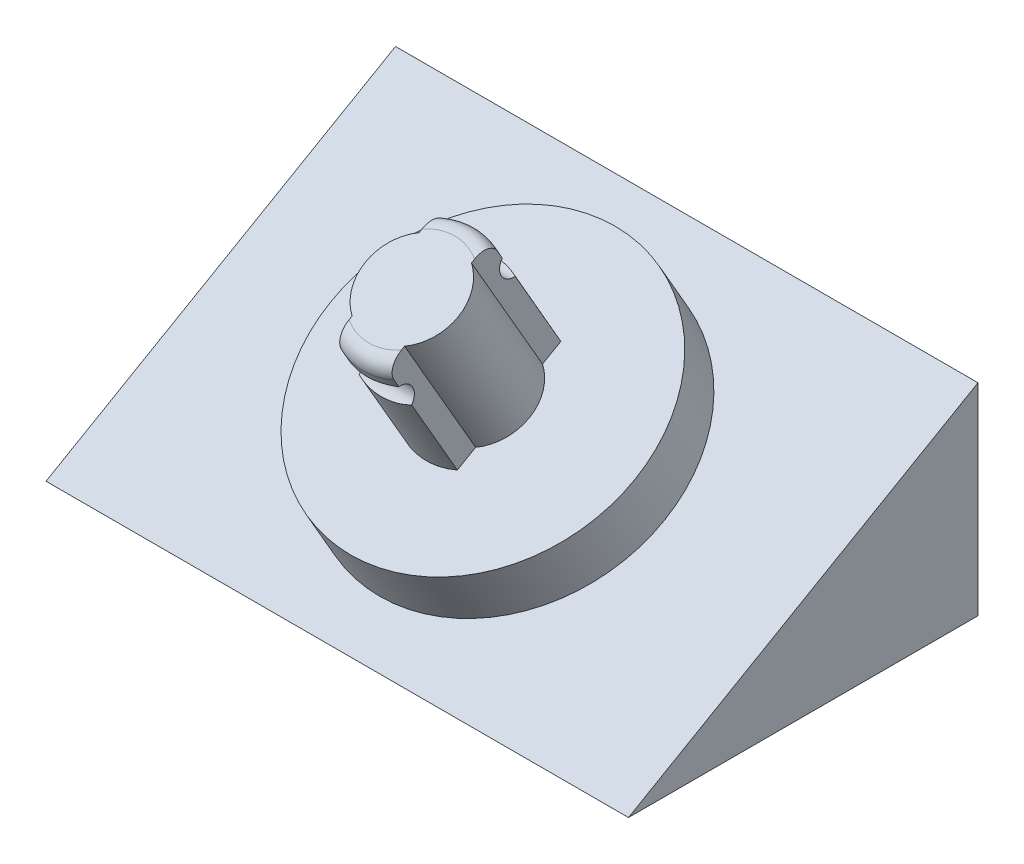
ISO-10303-21;
HEADER;
FILE_DESCRIPTION(('STEP AP214'),'2;1');
FILE_NAME('part.step','',(''),(''),'','','');
FILE_SCHEMA(('AUTOMOTIVE_DESIGN { 1 0 10303 214 1 1 1 1 }'));
ENDSEC;
DATA;
#1=APPLICATION_CONTEXT('core data for automotive mechanical design processes');
#2=APPLICATION_PROTOCOL_DEFINITION('international standard','automotive_design',2000,#1);
#3=PRODUCT_CONTEXT('',#1,'mechanical');
#4=PRODUCT('Part','Part','',(#3));
#5=PRODUCT_RELATED_PRODUCT_CATEGORY('part','',(#4));
#6=PRODUCT_DEFINITION_FORMATION('','',#4);
#7=PRODUCT_DEFINITION_CONTEXT('part definition',#1,'design');
#8=PRODUCT_DEFINITION('design','',#6,#7);
#9=PRODUCT_DEFINITION_SHAPE('','',#8);
#10=(LENGTH_UNIT() NAMED_UNIT(*) SI_UNIT(.MILLI.,.METRE.));
#11=(NAMED_UNIT(*) PLANE_ANGLE_UNIT() SI_UNIT($,.RADIAN.));
#12=(NAMED_UNIT(*) SI_UNIT($,.STERADIAN.) SOLID_ANGLE_UNIT());
#13=UNCERTAINTY_MEASURE_WITH_UNIT(LENGTH_MEASURE(1.E-05),#10,'distance_accuracy_value','');
#14=(GEOMETRIC_REPRESENTATION_CONTEXT(3) GLOBAL_UNCERTAINTY_ASSIGNED_CONTEXT((#13)) GLOBAL_UNIT_ASSIGNED_CONTEXT((#10,
#11,#12)) REPRESENTATION_CONTEXT('',''));
#15=CARTESIAN_POINT('',(0.,0.,0.));
#16=DIRECTION('',(0.,0.,1.));
#17=DIRECTION('',(1.,0.,0.));
#18=AXIS2_PLACEMENT_3D('',#15,#16,#17);
#19=CARTESIAN_POINT('',(0.,14.133534589762,5.15999999999996));
#20=DIRECTION('',(0.,-0.866025403784441,-0.499999999999995));
#21=DIRECTION('',(0.,0.499999999999995,-0.866025403784441));
#22=AXIS2_PLACEMENT_3D('',#19,#20,#21);
#23=CYLINDRICAL_SURFACE('',#22,3.36);
#24=DIRECTION('',(0.,-0.866025403784441,-0.499999999999995));
#25=VECTOR('',#24,1.);
#26=CARTESIAN_POINT('',(1.35,12.5951019458026,7.82464350336022));
#27=LINE('',#26,#25);
#28=CARTESIAN_POINT('',(1.35,11.902281622775,7.42464350336022));
#29=VERTEX_POINT('',#28);
#30=CARTESIAN_POINT('',(1.35,11.474942595738,7.17791920106515));
#31=VERTEX_POINT('',#30);
#32=EDGE_CURVE('E151',#29,#31,#27,.T.);
#33=ORIENTED_EDGE('',*,*,#32,.F.);
#34=CARTESIAN_POINT('',(0.,13.4407142667344,4.75999999999996));
#35=DIRECTION('',(0.,0.866025403784441,0.499999999999995));
#36=DIRECTION('',(0.,-0.499999999999995,0.866025403784441));
#37=AXIS2_PLACEMENT_3D('',#34,#35,#36);
#38=CIRCLE('',#37,3.36);
#39=CARTESIAN_POINT('',(-1.35,11.902281622775,7.42464350336022));
#40=VERTEX_POINT('',#39);
#41=EDGE_CURVE('E44',#29,#40,#38,.F.);
#42=ORIENTED_EDGE('',*,*,#41,.T.);
#43=DIRECTION('',(0.,-0.866025403784441,-0.499999999999995));
#44=VECTOR('',#43,1.);
#45=CARTESIAN_POINT('',(-1.35,12.5951019458026,7.82464350336022));
#46=LINE('',#45,#44);
#47=CARTESIAN_POINT('',(-1.35,11.474942595738,7.17791920106515));
#48=VERTEX_POINT('',#47);
#49=EDGE_CURVE('E170',#40,#48,#46,.T.);
#50=ORIENTED_EDGE('',*,*,#49,.T.);
#51=CARTESIAN_POINT('',(-1.35,11.474942595738,7.17791920106515));
#52=CARTESIAN_POINT('',(-1.31524674092889,11.4730057996449,7.19441032775255));
#53=CARTESIAN_POINT('',(-1.28011415016703,11.4706070055053,7.21001167578529));
#54=CARTESIAN_POINT('',(-1.20921149158938,11.4651583145601,7.23951555228648));
#55=CARTESIAN_POINT('',(-1.17344175679111,11.4621087492431,7.25341894001091));
#56=CARTESIAN_POINT('',(-1.06543820818072,11.4524009484729,7.2926783649312));
#57=CARTESIAN_POINT('',(-0.992380742451243,11.4451744339376,7.31564399241342));
#58=CARTESIAN_POINT('',(-0.844780945021744,11.4308072659534,7.3557892039299));
#59=CARTESIAN_POINT('',(-0.770239868811488,11.4236665474758,7.37297347685589));
#60=CARTESIAN_POINT('',(-0.620003417643745,11.4105934931077,7.40210955936677));
#61=CARTESIAN_POINT('',(-0.544307497436999,11.4046617482747,7.41405881285877));
#62=CARTESIAN_POINT('',(-0.389067871471121,11.3946071815524,7.4334807583596));
#63=CARTESIAN_POINT('',(-0.309493375402479,11.39056822737,7.44075046508685));
#64=CARTESIAN_POINT('',(-0.149953457735094,11.3852056311046,7.45027911421342));
#65=CARTESIAN_POINT('',(-0.0699880316881476,11.3838820199907,7.45253799946341));
#66=CARTESIAN_POINT('',(0.0899140355014441,11.3841191829942,7.45212712957189));
#67=CARTESIAN_POINT('',(0.16985067914592,11.3856795339944,7.44945809742448));
#68=CARTESIAN_POINT('',(0.329312658464556,11.3914848500906,7.43909491594956));
#69=CARTESIAN_POINT('',(0.408837930848945,11.3957302165794,7.43140001528089));
#70=CARTESIAN_POINT('',(0.56230730916055,11.4060193700597,7.41132969698036));
#71=CARTESIAN_POINT('',(0.636300022477691,11.4119399850374,7.39926277185656));
#72=CARTESIAN_POINT('',(0.783153331043058,11.424877652056,7.37008636623281));
#73=CARTESIAN_POINT('',(0.856014466650968,11.4318941618965,7.35297937564447));
#74=CARTESIAN_POINT('',(1.00029550961516,11.4459520087011,7.3132107116334));
#75=CARTESIAN_POINT('',(1.07171423194349,11.4529933609084,7.29054465718942));
#76=CARTESIAN_POINT('',(1.17731603417177,11.4624415246758,7.25192911806256));
#77=CARTESIAN_POINT('',(1.21229343107368,11.4654074619378,7.2382733066276));
#78=CARTESIAN_POINT('',(1.28163525962798,11.4707109389504,7.20933578316345));
#79=CARTESIAN_POINT('',(1.31599939588743,11.4730481831166,7.19405331104469));
#80=CARTESIAN_POINT('',(1.35,11.474942595738,7.17791920106515));
#81=B_SPLINE_CURVE_WITH_KNOTS('',3,(#51,#52,#53,#54,#55,#56,#57,#58,#59,#60,#61,#62,#63,#64,#65,
#66,#67,#68,#69,#70,#71,#72,#73,#74,#75,#76,#77,#78,#79,#80),.UNSPECIFIED.,.F.,.F.,(4,2,2,2,2,2,
2,2,2,2,2,2,2,2,4),(0.,0.115509403540561,0.230960108963442,0.461434291028042,0.691721096862035,
0.922120219416439,1.16193865639383,1.40175982853077,1.6415458183582,1.88136766314844,
2.10680191559827,2.33212498440665,2.55762620103973,2.67058286911161,2.78359255209051),.UNSPECIFIED.);
#82=EDGE_CURVE('E163',#48,#31,#81,.T.);
#83=ORIENTED_EDGE('',*,*,#82,.T.);
#84=EDGE_LOOP('',(#33,#42,#50,#83));
#85=FACE_BOUND('',#84,.T.);
#86=ADVANCED_FACE('F31',(#85),#23,.T.);
#87=CARTESIAN_POINT('',(0.,14.133534589762,5.15999999999996));
#88=DIRECTION('',(0.,-0.866025403784441,-0.499999999999995));
#89=DIRECTION('',(0.,0.499999999999995,-0.866025403784441));
#90=AXIS2_PLACEMENT_3D('',#87,#88,#89);
#91=CYLINDRICAL_SURFACE('',#90,3.36);
#92=DIRECTION('',(0.,-0.866025403784441,-0.499999999999995));
#93=VECTOR('',#92,1.);
#94=CARTESIAN_POINT('',(-1.35,15.6719672337214,2.4953564966397));
#95=LINE('',#94,#93);
#96=CARTESIAN_POINT('',(-1.35,14.9791469106939,2.0953564966397));
#97=VERTEX_POINT('',#96);
#98=CARTESIAN_POINT('',(-1.35,14.5518078836568,1.84863219434465));
#99=VERTEX_POINT('',#98);
#100=EDGE_CURVE('E324',#97,#99,#95,.T.);
#101=ORIENTED_EDGE('',*,*,#100,.F.);
#102=CARTESIAN_POINT('',(0.,13.4407142667344,4.75999999999996));
#103=DIRECTION('',(0.,0.866025403784441,0.499999999999995));
#104=DIRECTION('',(0.,-0.499999999999995,0.866025403784441));
#105=AXIS2_PLACEMENT_3D('',#102,#103,#104);
#106=CIRCLE('',#105,3.36);
#107=CARTESIAN_POINT('',(1.35,14.9791469106939,2.0953564966397));
#108=VERTEX_POINT('',#107);
#109=EDGE_CURVE('E254',#97,#108,#106,.F.);
#110=ORIENTED_EDGE('',*,*,#109,.T.);
#111=DIRECTION('',(0.,-0.866025403784441,-0.499999999999995));
#112=VECTOR('',#111,1.);
#113=CARTESIAN_POINT('',(1.35,15.6719672337214,2.4953564966397));
#114=LINE('',#113,#112);
#115=CARTESIAN_POINT('',(1.35,14.5518078836568,1.84863219434465));
#116=VERTEX_POINT('',#115);
#117=EDGE_CURVE('E327',#108,#116,#114,.T.);
#118=ORIENTED_EDGE('',*,*,#117,.T.);
#119=CARTESIAN_POINT('',(1.35,14.5518078836568,1.84863219434465));
#120=CARTESIAN_POINT('',(1.31524674092889,14.5651212202586,1.83870931638241));
#121=CARTESIAN_POINT('',(1.28011415016703,14.5774329869185,1.82883122570271));
#122=CARTESIAN_POINT('',(1.20921149158938,14.600259748006,1.80936058267619));
#123=CARTESIAN_POINT('',(1.1734417567911,14.6107756523155,1.79976788777894));
#124=CARTESIAN_POINT('',(1.06543820818071,14.6399214112493,1.7717309732369));
#125=CARTESIAN_POINT('',(0.992380742451236,14.6561969707951,1.75398981432738));
#126=CARTESIAN_POINT('',(0.844780945021734,14.6837801598167,1.72147487611445));
#127=CARTESIAN_POINT('',(0.770239868811476,14.6950918174773,1.70669869604857));
#128=CARTESIAN_POINT('',(0.620003417643732,14.7137878779144,1.68080905760528));
#129=CARTESIAN_POINT('',(0.544307497436983,14.7211703625782,1.6696973891451));
#130=CARTESIAN_POINT('',(0.389067871471102,14.7329629774118,1.65127890618915));
#131=CARTESIAN_POINT('',(0.309493375402458,14.7372392510244,1.64414621589885));
#132=CARTESIAN_POINT('',(0.14995345773507,14.7428100050991,1.63473774673953));
#133=CARTESIAN_POINT('',(0.0699880316881223,14.7441044515528,1.63246202326511));
#134=CARTESIAN_POINT('',(-0.0899140355014724,14.7438672092909,1.63287284739678));
#135=CARTESIAN_POINT('',(-0.16985067914595,14.7423359351478,1.63555866707544));
#136=CARTESIAN_POINT('',(-0.32931265846459,14.7362638147746,1.64576780902921));
#137=CARTESIAN_POINT('',(-0.408837930848979,14.7317225185604,1.65329185459128));
#138=CARTESIAN_POINT('',(-0.562307309160583,14.7194856897902,1.67223768203888));
#139=CARTESIAN_POINT('',(-0.636300022477721,14.7119957335763,1.68339854757753));
#140=CARTESIAN_POINT('',(-0.783153331043081,14.6931970586243,1.70919109869317));
#141=CARTESIAN_POINT('',(-0.856014466650988,14.6818902251127,1.7238210697551));
#142=CARTESIAN_POINT('',(-1.00029550961517,14.6544784752069,1.75587985421599));
#143=CARTESIAN_POINT('',(-1.0717142319435,14.6383697723585,1.7733108713265));
#144=CARTESIAN_POINT('',(-1.17731603417177,14.6096518163775,1.80080099073163));
#145=CARTESIAN_POINT('',(-1.21229343107369,14.5993085053965,1.81019747346401));
#146=CARTESIAN_POINT('',(-1.28163525962798,14.5768996134603,1.82925918101737));
#147=CARTESIAN_POINT('',(-1.31599939588744,14.5648332264559,1.8389245298995));
#148=CARTESIAN_POINT('',(-1.35,14.5518078836568,1.84863219434465));
#149=B_SPLINE_CURVE_WITH_KNOTS('',3,(#119,#120,#121,#122,#123,#124,#125,#126,#127,#128,#129,
#130,#131,#132,#133,#134,#135,#136,#137,#138,#139,#140,#141,#142,#143,#144,#145,#146,#147,#148),
.UNSPECIFIED.,.F.,.F.,(4,2,2,2,2,2,2,2,2,2,2,2,2,2,4),(0.,0.115509403540563,0.230960108963447,
0.46143429102805,0.691721096862048,0.922120219416456,1.16193865639385,1.40175982853079,
1.64154581835823,1.88136766314848,2.10680191559829,2.33212498440667,2.55762620103974,
2.67058286911161,2.78359255209051),.UNSPECIFIED.);
#150=EDGE_CURVE('E278',#116,#99,#149,.T.);
#151=ORIENTED_EDGE('',*,*,#150,.T.);
#152=EDGE_LOOP('',(#101,#110,#118,#151));
#153=FACE_BOUND('',#152,.T.);
#154=ADVANCED_FACE('F270',(#153),#91,.T.);
#155=CARTESIAN_POINT('',(0.,7.79422863405988,1.49999999999999));
#156=DIRECTION('',(0.,-0.866025403784441,-0.499999999999995));
#157=DIRECTION('',(0.,0.499999999999995,-0.866025403784441));
#158=AXIS2_PLACEMENT_3D('',#155,#156,#157);
#159=PLANE('',#158);
#160=CARTESIAN_POINT('',(0.,7.79422863405988,1.49999999999999));
#161=DIRECTION('',(0.,-0.866025403784441,-0.499999999999995));
#162=DIRECTION('',(0.,0.499999999999995,-0.866025403784441));
#163=AXIS2_PLACEMENT_3D('',#160,#161,#162);
#164=CIRCLE('',#163,7.86);
#165=CARTESIAN_POINT('',(0.,11.7242286340599,-5.30695967374572));
#166=VERTEX_POINT('',#165);
#167=EDGE_CURVE('E213',#166,#166,#164,.T.);
#168=ORIENTED_EDGE('',*,*,#167,.F.);
#169=EDGE_LOOP('',(#168));
#170=FACE_BOUND('',#169,.T.);
#171=CARTESIAN_POINT('',(0.,7.79422863405989,1.49999999999999));
#172=DIRECTION('',(0.,0.866025403784441,0.499999999999995));
#173=DIRECTION('',(0.,-0.499999999999995,0.866025403784441));
#174=AXIS2_PLACEMENT_3D('',#171,#172,#173);
#175=CIRCLE('',#174,2.405);
#176=CARTESIAN_POINT('',(-1.35,8.78940763805866,-0.223700597551689));
#177=VERTEX_POINT('',#176);
#178=CARTESIAN_POINT('',(-1.35,6.79904963006112,3.22370059755167));
#179=VERTEX_POINT('',#178);
#180=EDGE_CURVE('E284',#177,#179,#175,.T.);
#181=ORIENTED_EDGE('',*,*,#180,.F.);
#182=DIRECTION('',(0.,-0.499999999999995,0.866025403784441));
#183=VECTOR('',#182,1.);
#184=CARTESIAN_POINT('',(-1.35,8.78940763805866,-0.223700597551689));
#185=LINE('',#184,#183);
#186=CARTESIAN_POINT('',(-1.35,9.3326612780193,-1.16464350336027));
#187=VERTEX_POINT('',#186);
#188=EDGE_CURVE('E289',#187,#177,#185,.T.);
#189=ORIENTED_EDGE('',*,*,#188,.F.);
#190=CARTESIAN_POINT('',(0.,7.79422863405989,1.49999999999999));
#191=DIRECTION('',(0.,0.866025403784441,0.499999999999995));
#192=DIRECTION('',(0.,-0.499999999999995,0.866025403784441));
#193=AXIS2_PLACEMENT_3D('',#190,#191,#192);
#194=CIRCLE('',#193,3.36);
#195=CARTESIAN_POINT('',(1.35,9.3326612780193,-1.16464350336027));
#196=VERTEX_POINT('',#195);
#197=EDGE_CURVE('E316',#196,#187,#194,.T.);
#198=ORIENTED_EDGE('',*,*,#197,.F.);
#199=DIRECTION('',(0.,0.499999999999995,-0.866025403784441));
#200=VECTOR('',#199,1.);
#201=CARTESIAN_POINT('',(1.35,8.78940763805866,-0.223700597551689));
#202=LINE('',#201,#200);
#203=CARTESIAN_POINT('',(1.35,8.78940763805866,-0.223700597551694));
#204=VERTEX_POINT('',#203);
#205=EDGE_CURVE('E313',#204,#196,#202,.T.);
#206=ORIENTED_EDGE('',*,*,#205,.F.);
#207=CARTESIAN_POINT('',(0.,7.79422863405989,1.49999999999999));
#208=DIRECTION('',(0.,0.866025403784441,0.499999999999995));
#209=DIRECTION('',(0.,-0.499999999999995,0.866025403784441));
#210=AXIS2_PLACEMENT_3D('',#207,#208,#209);
#211=CIRCLE('',#210,2.405);
#212=CARTESIAN_POINT('',(1.35,6.79904963006112,3.22370059755167));
#213=VERTEX_POINT('',#212);
#214=EDGE_CURVE('E310',#213,#204,#211,.T.);
#215=ORIENTED_EDGE('',*,*,#214,.F.);
#216=DIRECTION('',(0.,0.499999999999995,-0.866025403784442));
#217=VECTOR('',#216,1.);
#218=CARTESIAN_POINT('',(1.35,6.25579599010047,4.16464350336025));
#219=LINE('',#218,#217);
#220=CARTESIAN_POINT('',(1.35,6.25579599010047,4.16464350336025));
#221=VERTEX_POINT('',#220);
#222=EDGE_CURVE('E307',#221,#213,#219,.T.);
#223=ORIENTED_EDGE('',*,*,#222,.F.);
#224=CARTESIAN_POINT('',(0.,7.79422863405989,1.49999999999999));
#225=DIRECTION('',(0.,0.866025403784441,0.499999999999995));
#226=DIRECTION('',(0.,-0.499999999999995,0.866025403784441));
#227=AXIS2_PLACEMENT_3D('',#224,#225,#226);
#228=CIRCLE('',#227,3.36);
#229=CARTESIAN_POINT('',(-1.35,6.25579599010047,4.16464350336025));
#230=VERTEX_POINT('',#229);
#231=EDGE_CURVE('E305',#230,#221,#228,.T.);
#232=ORIENTED_EDGE('',*,*,#231,.F.);
#233=DIRECTION('',(0.,-0.499999999999995,0.866025403784442));
#234=VECTOR('',#233,1.);
#235=CARTESIAN_POINT('',(-1.35,6.25579599010047,4.16464350336025));
#236=LINE('',#235,#234);
#237=EDGE_CURVE('E206',#179,#230,#236,.T.);
#238=ORIENTED_EDGE('',*,*,#237,.F.);
#239=EDGE_LOOP('',(#181,#189,#198,#206,#215,#223,#232,#238));
#240=FACE_BOUND('',#239,.T.);
#241=ADVANCED_FACE('F338',(#170,#240),#159,.F.);
#242=CARTESIAN_POINT('',(15.,0.,-9.));
#243=DIRECTION('',(0.,1.,0.));
#244=DIRECTION('',(0.,0.,1.));
#245=AXIS2_PLACEMENT_3D('',#242,#243,#244);
#246=PLANE('',#245);
#247=DIRECTION('',(0.,0.,-1.));
#248=VECTOR('',#247,1.);
#249=CARTESIAN_POINT('',(-15.,0.,-9.));
#250=LINE('',#249,#248);
#251=CARTESIAN_POINT('',(-15.,0.,9.));
#252=VERTEX_POINT('',#251);
#253=CARTESIAN_POINT('',(-15.,0.,-9.));
#254=VERTEX_POINT('',#253);
#255=EDGE_CURVE('E216',#252,#254,#250,.T.);
#256=ORIENTED_EDGE('',*,*,#255,.T.);
#257=DIRECTION('',(-1.,0.,0.));
#258=VECTOR('',#257,1.);
#259=CARTESIAN_POINT('',(15.,0.,-9.));
#260=LINE('',#259,#258);
#261=CARTESIAN_POINT('',(15.,0.,-9.));
#262=VERTEX_POINT('',#261);
#263=EDGE_CURVE('E238',#262,#254,#260,.T.);
#264=ORIENTED_EDGE('',*,*,#263,.F.);
#265=DIRECTION('',(0.,0.,-1.));
#266=VECTOR('',#265,1.);
#267=CARTESIAN_POINT('',(15.,0.,-9.));
#268=LINE('',#267,#266);
#269=CARTESIAN_POINT('',(15.,0.,9.));
#270=VERTEX_POINT('',#269);
#271=EDGE_CURVE('E219',#270,#262,#268,.T.);
#272=ORIENTED_EDGE('',*,*,#271,.F.);
#273=DIRECTION('',(-1.,0.,0.));
#274=VECTOR('',#273,1.);
#275=CARTESIAN_POINT('',(15.,0.,9.));
#276=LINE('',#275,#274);
#277=EDGE_CURVE('E227',#270,#252,#276,.T.);
#278=ORIENTED_EDGE('',*,*,#277,.T.);
#279=EDGE_LOOP('',(#256,#264,#272,#278));
#280=FACE_BOUND('',#279,.T.);
#281=ADVANCED_FACE('F400',(#280),#246,.F.);
#282=CARTESIAN_POINT('',(15.,10.3923048454131,-9.));
#283=DIRECTION('',(0.,0.,1.));
#284=DIRECTION('',(0.,-1.,0.));
#285=AXIS2_PLACEMENT_3D('',#282,#283,#284);
#286=PLANE('',#285);
#287=DIRECTION('',(0.,1.,0.));
#288=VECTOR('',#287,1.);
#289=CARTESIAN_POINT('',(-15.,10.3923048454131,-9.));
#290=LINE('',#289,#288);
#291=CARTESIAN_POINT('',(-15.,10.3923048454131,-9.));
#292=VERTEX_POINT('',#291);
#293=EDGE_CURVE('E230',#254,#292,#290,.T.);
#294=ORIENTED_EDGE('',*,*,#293,.T.);
#295=DIRECTION('',(-1.,0.,0.));
#296=VECTOR('',#295,1.);
#297=CARTESIAN_POINT('',(15.,10.3923048454131,-9.));
#298=LINE('',#297,#296);
#299=CARTESIAN_POINT('',(15.,10.3923048454131,-9.));
#300=VERTEX_POINT('',#299);
#301=EDGE_CURVE('E235',#300,#292,#298,.T.);
#302=ORIENTED_EDGE('',*,*,#301,.F.);
#303=DIRECTION('',(0.,1.,0.));
#304=VECTOR('',#303,1.);
#305=CARTESIAN_POINT('',(15.,10.3923048454131,-9.));
#306=LINE('',#305,#304);
#307=EDGE_CURVE('E222',#262,#300,#306,.T.);
#308=ORIENTED_EDGE('',*,*,#307,.F.);
#309=ORIENTED_EDGE('',*,*,#263,.T.);
#310=EDGE_LOOP('',(#294,#302,#308,#309));
#311=FACE_BOUND('',#310,.T.);
#312=ADVANCED_FACE('F416',(#311),#286,.F.);
#313=CARTESIAN_POINT('',(15.,0.,9.));
#314=DIRECTION('',(0.,-0.866025403784441,-0.499999999999995));
#315=DIRECTION('',(0.,0.499999999999995,-0.866025403784441));
#316=AXIS2_PLACEMENT_3D('',#313,#314,#315);
#317=PLANE('',#316);
#318=CARTESIAN_POINT('',(0.,5.19615242270656,0.));
#319=DIRECTION('',(0.,-0.866025403784441,-0.499999999999995));
#320=DIRECTION('',(0.,0.499999999999995,-0.866025403784441));
#321=AXIS2_PLACEMENT_3D('',#318,#319,#320);
#322=CIRCLE('',#321,7.86);
#323=CARTESIAN_POINT('',(0.,9.12615242270653,-6.80695967374571));
#324=VERTEX_POINT('',#323);
#325=EDGE_CURVE('E212',#324,#324,#322,.T.);
#326=ORIENTED_EDGE('',*,*,#325,.T.);
#327=EDGE_LOOP('',(#326));
#328=FACE_BOUND('',#327,.T.);
#329=DIRECTION('',(0.,-0.499999999999995,0.866025403784441));
#330=VECTOR('',#329,1.);
#331=CARTESIAN_POINT('',(-15.,0.,9.));
#332=LINE('',#331,#330);
#333=EDGE_CURVE('E223',#292,#252,#332,.T.);
#334=ORIENTED_EDGE('',*,*,#333,.T.);
#335=ORIENTED_EDGE('',*,*,#277,.F.);
#336=DIRECTION('',(0.,-0.499999999999995,0.866025403784441));
#337=VECTOR('',#336,1.);
#338=CARTESIAN_POINT('',(15.,0.,9.));
#339=LINE('',#338,#337);
#340=EDGE_CURVE('E225',#300,#270,#339,.T.);
#341=ORIENTED_EDGE('',*,*,#340,.F.);
#342=ORIENTED_EDGE('',*,*,#301,.T.);
#343=EDGE_LOOP('',(#334,#335,#341,#342));
#344=FACE_BOUND('',#343,.T.);
#345=ADVANCED_FACE('F409',(#328,#344),#317,.F.);
#346=CARTESIAN_POINT('',(15.,0.,-9.));
#347=DIRECTION('',(1.,0.,0.));
#348=DIRECTION('',(0.,0.,-1.));
#349=AXIS2_PLACEMENT_3D('',#346,#347,#348);
#350=PLANE('',#349);
#351=ORIENTED_EDGE('',*,*,#271,.T.);
#352=ORIENTED_EDGE('',*,*,#307,.T.);
#353=ORIENTED_EDGE('',*,*,#340,.T.);
#354=EDGE_LOOP('',(#351,#352,#353));
#355=FACE_BOUND('',#354,.T.);
#356=ADVANCED_FACE('F406',(#355),#350,.T.);
#357=CARTESIAN_POINT('',(-15.,0.,-9.));
#358=DIRECTION('',(1.,0.,0.));
#359=DIRECTION('',(0.,0.,-1.));
#360=AXIS2_PLACEMENT_3D('',#357,#358,#359);
#361=PLANE('',#360);
#362=ORIENTED_EDGE('',*,*,#255,.F.);
#363=ORIENTED_EDGE('',*,*,#333,.F.);
#364=ORIENTED_EDGE('',*,*,#293,.F.);
#365=EDGE_LOOP('',(#362,#363,#364));
#366=FACE_BOUND('',#365,.T.);
#367=ADVANCED_FACE('F404',(#366),#361,.F.);
#368=CARTESIAN_POINT('',(0.,7.79422863405988,1.49999999999999));
#369=DIRECTION('',(0.,-0.866025403784441,-0.499999999999995));
#370=DIRECTION('',(0.,0.499999999999995,-0.866025403784441));
#371=AXIS2_PLACEMENT_3D('',#368,#369,#370);
#372=CYLINDRICAL_SURFACE('',#371,7.86);
#373=ORIENTED_EDGE('',*,*,#167,.T.);
#374=EDGE_LOOP('',(#373));
#375=FACE_BOUND('',#374,.T.);
#376=ORIENTED_EDGE('',*,*,#325,.F.);
#377=EDGE_LOOP('',(#376));
#378=FACE_BOUND('',#377,.T.);
#379=ADVANCED_FACE('F394',(#375,#378),#372,.T.);
#380=CARTESIAN_POINT('',(0.,14.133534589762,5.15999999999996));
#381=DIRECTION('',(0.,-0.866025403784441,-0.499999999999995));
#382=DIRECTION('',(0.,0.499999999999995,-0.866025403784441));
#383=AXIS2_PLACEMENT_3D('',#380,#381,#382);
#384=CYLINDRICAL_SURFACE('',#383,2.405);
#385=ORIENTED_EDGE('',*,*,#180,.T.);
#386=DIRECTION('',(0.,-0.866025403784441,-0.499999999999995));
#387=VECTOR('',#386,1.);
#388=CARTESIAN_POINT('',(-1.35,13.1383555857632,6.88370059755164));
#389=LINE('',#388,#387);
#390=CARTESIAN_POINT('',(-1.35,13.1383555857632,6.88370059755164));
#391=VERTEX_POINT('',#390);
#392=EDGE_CURVE('E208',#391,#179,#389,.T.);
#393=ORIENTED_EDGE('',*,*,#392,.F.);
#394=CARTESIAN_POINT('',(0.,14.133534589762,5.15999999999996));
#395=DIRECTION('',(0.,0.866025403784441,0.499999999999995));
#396=DIRECTION('',(0.,-0.499999999999995,0.866025403784441));
#397=AXIS2_PLACEMENT_3D('',#394,#395,#396);
#398=CIRCLE('',#397,2.405);
#399=CARTESIAN_POINT('',(-1.35,15.1287135937608,3.43629940244828));
#400=VERTEX_POINT('',#399);
#401=EDGE_CURVE('E285',#400,#391,#398,.T.);
#402=ORIENTED_EDGE('',*,*,#401,.F.);
#403=DIRECTION('',(0.,-0.866025403784441,-0.499999999999995));
#404=VECTOR('',#403,1.);
#405=CARTESIAN_POINT('',(-1.35,15.1287135937608,3.43629940244828));
#406=LINE('',#405,#404);
#407=EDGE_CURVE('E301',#400,#177,#406,.T.);
#408=ORIENTED_EDGE('',*,*,#407,.T.);
#409=EDGE_LOOP('',(#385,#393,#402,#408));
#410=FACE_BOUND('',#409,.T.);
#411=ADVANCED_FACE('F365',(#410),#384,.T.);
#412=CARTESIAN_POINT('',(-1.35,12.5951019458026,7.82464350336022));
#413=DIRECTION('',(1.,0.,0.));
#414=DIRECTION('',(0.,0.,-1.));
#415=AXIS2_PLACEMENT_3D('',#412,#413,#414);
#416=PLANE('',#415);
#417=ORIENTED_EDGE('',*,*,#49,.F.);
#418=CARTESIAN_POINT('',(-1.35,11.902281622775,7.42464350336022));
#419=CARTESIAN_POINT('',(-1.35,11.9386952103843,7.44572402558345));
#420=CARTESIAN_POINT('',(-1.35,11.9769446165227,7.46356870174546));
#421=CARTESIAN_POINT('',(-1.35,12.0558109242223,7.49247796774207));
#422=CARTESIAN_POINT('',(-1.35,12.0964210724876,7.50356094709427));
#423=CARTESIAN_POINT('',(-1.35,12.1789099384355,7.51875523391763));
#424=CARTESIAN_POINT('',(-1.35,12.2207884456627,7.5228676916073));
#425=CARTESIAN_POINT('',(-1.35,12.3046585161928,7.52420929240684));
#426=CARTESIAN_POINT('',(-1.35,12.3466501167123,7.52143579357193));
#427=CARTESIAN_POINT('',(-1.35,12.4308284775788,7.50913032920145));
#428=CARTESIAN_POINT('',(-1.35,12.472987519353,7.49941050178339));
#429=CARTESIAN_POINT('',(-1.35,12.5552665393765,7.47354753249794));
#430=CARTESIAN_POINT('',(-1.35,12.5953864718788,7.45740424659336));
#431=CARTESIAN_POINT('',(-1.35,12.6758023098857,7.41787951400579));
#432=CARTESIAN_POINT('',(-1.35,12.7158687135952,7.39403237632521));
#433=CARTESIAN_POINT('',(-1.35,12.7919855819077,7.34055414908151));
#434=CARTESIAN_POINT('',(-1.35,12.8280304982693,7.31091522018039));
#435=CARTESIAN_POINT('',(-1.35,12.8980618716458,7.24441850661685));
#436=CARTESIAN_POINT('',(-1.35,12.9316902155138,7.20718566492241));
#437=CARTESIAN_POINT('',(-1.35,12.9931904156201,7.12840742161469));
#438=CARTESIAN_POINT('',(-1.35,13.021079514719,7.0868755183601));
#439=CARTESIAN_POINT('',(-1.35,13.0459799934313,7.04369981684977));
#440=B_SPLINE_CURVE_WITH_KNOTS('',3,(#418,#419,#420,#421,#422,#423,#424,#425,#426,#427,#428,
#429,#430,#431,#432,#433,#434,#435,#436,#437,#438,#439),.UNSPECIFIED.,.F.,.F.,(4,2,2,2,2,2,2,2,
2,2,4),(0.,0.126022853535804,0.251701421852658,0.377359249699756,0.503065296314877,
0.632306328327749,0.761550258555728,0.900856883127317,1.04035338540645,1.19033035240644,
1.33984993285549),.UNSPECIFIED.);
#441=CARTESIAN_POINT('',(-1.35,13.0459799934313,7.04369981684977));
#442=VERTEX_POINT('',#441);
#443=EDGE_CURVE('E11',#40,#442,#440,.T.);
#444=ORIENTED_EDGE('',*,*,#443,.T.);
#445=DIRECTION('',(0.,-0.499999999999995,0.866025403784442));
#446=VECTOR('',#445,1.);
#447=CARTESIAN_POINT('',(-1.35,12.5951019458026,7.82464350336022));
#448=LINE('',#447,#446);
#449=EDGE_CURVE('E288',#391,#442,#448,.T.);
#450=ORIENTED_EDGE('',*,*,#449,.F.);
#451=ORIENTED_EDGE('',*,*,#392,.T.);
#452=ORIENTED_EDGE('',*,*,#237,.T.);
#453=CARTESIAN_POINT('',(-1.35,10.3377622211078,6.52136780565524));
#454=VERTEX_POINT('',#453);
#455=EDGE_CURVE('E157',#454,#230,#46,.T.);
#456=ORIENTED_EDGE('',*,*,#455,.F.);
#457=CARTESIAN_POINT('',(-1.35,10.7647850523823,7.09484535671565));
#458=DIRECTION('',(1.,0.,0.));
#459=DIRECTION('',(0.,0.,-1.));
#460=AXIS2_PLACEMENT_3D('',#457,#458,#459);
#461=CIRCLE('',#460,0.714999999999982);
#462=EDGE_CURVE('E172',#454,#48,#461,.T.);
#463=ORIENTED_EDGE('',*,*,#462,.T.);
#464=EDGE_LOOP('',(#417,#444,#450,#451,#452,#456,#463));
#465=FACE_BOUND('',#464,.T.);
#466=ADVANCED_FACE('F204',(#465),#416,.F.);
#467=CARTESIAN_POINT('',(1.35,10.3377622211078,6.52136780565524));
#468=VERTEX_POINT('',#467);
#469=EDGE_CURVE('E158',#468,#221,#27,.T.);
#470=ORIENTED_EDGE('',*,*,#469,.F.);
#471=CARTESIAN_POINT('',(1.35,10.3377622211078,6.52136780565524));
#472=CARTESIAN_POINT('',(1.3152467409289,10.324448884506,6.53129068361748));
#473=CARTESIAN_POINT('',(1.28011415016703,10.3121371178461,6.54116877429717));
#474=CARTESIAN_POINT('',(1.20921149158938,10.2893103567586,6.56063941732369));
#475=CARTESIAN_POINT('',(1.17344175679111,10.2787944524491,6.57023211222094));
#476=CARTESIAN_POINT('',(1.06543820818072,10.2496486935152,6.59826902676299));
#477=CARTESIAN_POINT('',(0.992380742451244,10.2333731339694,6.6160101856725));
#478=CARTESIAN_POINT('',(0.844780945021745,10.2057899449479,6.64852512388543));
#479=CARTESIAN_POINT('',(0.770239868811489,10.1944782872873,6.66330130395131));
#480=CARTESIAN_POINT('',(0.620003417643747,10.1757822268501,6.6891909423946));
#481=CARTESIAN_POINT('',(0.544307497437,10.1683997421863,6.70030261085478));
#482=CARTESIAN_POINT('',(0.389067871471123,10.1566071273528,6.71872109381073));
#483=CARTESIAN_POINT('',(0.30949337540248,10.1523308537402,6.72585378410103));
#484=CARTESIAN_POINT('',(0.149953457735096,10.1467600996655,6.73526225326035));
#485=CARTESIAN_POINT('',(0.0699880316881493,10.1454656532117,6.73753797673477));
#486=CARTESIAN_POINT('',(-0.0899140355014423,10.1457028954737,6.7371271526031));
#487=CARTESIAN_POINT('',(-0.169850679145918,10.1472341696168,6.73444133292445));
#488=CARTESIAN_POINT('',(-0.329312658464555,10.15330628999,6.72423219097068));
#489=CARTESIAN_POINT('',(-0.408837930848943,10.1578475862042,6.71670814540861));
#490=CARTESIAN_POINT('',(-0.562307309160548,10.1700844149744,6.697762317961));
#491=CARTESIAN_POINT('',(-0.636300022477688,10.1775743711883,6.68660145242236));
#492=CARTESIAN_POINT('',(-0.783153331043056,10.1963730461403,6.66080890130672));
#493=CARTESIAN_POINT('',(-0.856014466650966,10.2076798796519,6.64617893024479));
#494=CARTESIAN_POINT('',(-1.00029550961516,10.2350916295577,6.6141201457839));
#495=CARTESIAN_POINT('',(-1.07171423194348,10.2512003324061,6.59668912867339));
#496=CARTESIAN_POINT('',(-1.17731603417176,10.2799182883871,6.56919900926826));
#497=CARTESIAN_POINT('',(-1.21229343107368,10.2902615993681,6.55980252653588));
#498=CARTESIAN_POINT('',(-1.28163525962798,10.3126704913043,6.54074081898251));
#499=CARTESIAN_POINT('',(-1.31599939588743,10.3247368783087,6.53107547010039));
#500=CARTESIAN_POINT('',(-1.35,10.3377622211078,6.52136780565524));
#501=B_SPLINE_CURVE_WITH_KNOTS('',3,(#471,#472,#473,#474,#475,#476,#477,#478,#479,#480,#481,
#482,#483,#484,#485,#486,#487,#488,#489,#490,#491,#492,#493,#494,#495,#496,#497,#498,#499,#500),
.UNSPECIFIED.,.F.,.F.,(4,2,2,2,2,2,2,2,2,2,2,2,2,2,4),(0.,0.115509403540561,0.230960108963443,
0.461434291028041,0.691721096862035,0.922120219416439,1.16193865639383,1.40175982853076,
1.6415458183582,1.88136766314844,2.10680191559827,2.33212498440665,2.55762620103973,
2.67058286911161,2.78359255209051),.UNSPECIFIED.);
#502=EDGE_CURVE('E166',#468,#454,#501,.T.);
#503=ORIENTED_EDGE('',*,*,#502,.T.);
#504=ORIENTED_EDGE('',*,*,#455,.T.);
#505=ORIENTED_EDGE('',*,*,#231,.T.);
#506=EDGE_LOOP('',(#470,#503,#504,#505));
#507=FACE_BOUND('',#506,.T.);
#508=ADVANCED_FACE('F184',(#507),#23,.T.);
#509=CARTESIAN_POINT('',(1.35,12.5951019458026,7.82464350336022));
#510=DIRECTION('',(-1.,0.,0.));
#511=DIRECTION('',(0.,0.,1.));
#512=AXIS2_PLACEMENT_3D('',#509,#510,#511);
#513=PLANE('',#512);
#514=DIRECTION('',(0.,0.499999999999995,-0.866025403784442));
#515=VECTOR('',#514,1.);
#516=CARTESIAN_POINT('',(1.35,12.5951019458026,7.82464350336022));
#517=LINE('',#516,#515);
#518=CARTESIAN_POINT('',(1.35,13.0459799934313,7.04369981684977));
#519=VERTEX_POINT('',#518);
#520=CARTESIAN_POINT('',(1.35,13.1383555857632,6.88370059755164));
#521=VERTEX_POINT('',#520);
#522=EDGE_CURVE('E292',#519,#521,#517,.T.);
#523=ORIENTED_EDGE('',*,*,#522,.F.);
#524=CARTESIAN_POINT('',(1.35,13.0459799934313,7.04369981684977));
#525=CARTESIAN_POINT('',(1.35,13.0175425829018,7.09303649550661));
#526=CARTESIAN_POINT('',(1.35,12.9851751786981,7.14023395104988));
#527=CARTESIAN_POINT('',(1.35,12.9129265484631,7.22894356408338));
#528=CARTESIAN_POINT('',(1.35,12.8730000576754,7.27041872609909));
#529=CARTESIAN_POINT('',(1.35,12.7861607822944,7.34578430563763));
#530=CARTESIAN_POINT('',(1.35,12.7392189687171,7.37964166909821));
#531=CARTESIAN_POINT('',(1.35,12.6397849301983,7.43763375157774));
#532=CARTESIAN_POINT('',(1.35,12.5873087381577,7.4617956314026));
#533=CARTESIAN_POINT('',(1.35,12.4850915626437,7.49661936197907));
#534=CARTESIAN_POINT('',(1.35,12.4357863937377,7.50855978620479));
#535=CARTESIAN_POINT('',(1.35,12.3357562343281,7.52286672026294));
#536=CARTESIAN_POINT('',(1.35,12.2850311590292,7.52523265708409));
#537=CARTESIAN_POINT('',(1.35,12.1897280330996,7.52020428978118));
#538=CARTESIAN_POINT('',(1.35,12.1450918962889,7.51386286510989));
#539=CARTESIAN_POINT('',(1.35,12.0577429450479,7.49323895492527));
#540=CARTESIAN_POINT('',(1.35,12.0150260331741,7.47897435011207));
#541=CARTESIAN_POINT('',(1.35,11.9617375552904,7.45557439029544));
#542=CARTESIAN_POINT('',(1.35,11.9496003672852,7.44984081001748));
#543=CARTESIAN_POINT('',(1.35,11.9256770986649,7.4377254649488));
#544=CARTESIAN_POINT('',(1.35,11.913890512112,7.43134469927301));
#545=CARTESIAN_POINT('',(1.35,11.902281622775,7.42464350336024));
#546=B_SPLINE_CURVE_WITH_KNOTS('',3,(#524,#525,#526,#527,#528,#529,#530,#531,#532,#533,#534,
#535,#536,#537,#538,#539,#540,#541,#542,#543,#544,#545),.UNSPECIFIED.,.F.,.F.,(4,2,2,2,2,2,2,2,
2,2,4),(0.,0.170835647994323,0.342728633965059,0.515353675656705,0.687491693854312,
0.838827450289622,0.990172263691497,1.12474003390992,1.25900534392151,1.29926148040111,
1.33945638959675),.UNSPECIFIED.);
#547=EDGE_CURVE('E58',#519,#29,#546,.T.);
#548=ORIENTED_EDGE('',*,*,#547,.T.);
#549=ORIENTED_EDGE('',*,*,#32,.T.);
#550=CARTESIAN_POINT('',(1.35,10.7647850523823,7.09484535671565));
#551=DIRECTION('',(-1.,0.,0.));
#552=DIRECTION('',(0.,0.,1.));
#553=AXIS2_PLACEMENT_3D('',#550,#551,#552);
#554=CIRCLE('',#553,0.714999999999982);
#555=EDGE_CURVE('E154',#31,#468,#554,.T.);
#556=ORIENTED_EDGE('',*,*,#555,.T.);
#557=ORIENTED_EDGE('',*,*,#469,.T.);
#558=ORIENTED_EDGE('',*,*,#222,.T.);
#559=DIRECTION('',(0.,-0.866025403784441,-0.499999999999995));
#560=VECTOR('',#559,1.);
#561=CARTESIAN_POINT('',(1.35,13.1383555857632,6.88370059755164));
#562=LINE('',#561,#560);
#563=EDGE_CURVE('E331',#521,#213,#562,.T.);
#564=ORIENTED_EDGE('',*,*,#563,.F.);
#565=EDGE_LOOP('',(#523,#548,#549,#556,#557,#558,#564));
#566=FACE_BOUND('',#565,.T.);
#567=ADVANCED_FACE('F153',(#566),#513,.F.);
#568=CARTESIAN_POINT('',(0.,14.133534589762,5.15999999999996));
#569=DIRECTION('',(0.,-0.866025403784441,-0.499999999999995));
#570=DIRECTION('',(0.,0.499999999999995,-0.866025403784441));
#571=AXIS2_PLACEMENT_3D('',#568,#569,#570);
#572=CYLINDRICAL_SURFACE('',#571,2.405);
#573=ORIENTED_EDGE('',*,*,#214,.T.);
#574=DIRECTION('',(0.,-0.866025403784441,-0.499999999999995));
#575=VECTOR('',#574,1.);
#576=CARTESIAN_POINT('',(1.35,15.1287135937608,3.43629940244828));
#577=LINE('',#576,#575);
#578=CARTESIAN_POINT('',(1.35,15.1287135937608,3.43629940244828));
#579=VERTEX_POINT('',#578);
#580=EDGE_CURVE('E329',#579,#204,#577,.T.);
#581=ORIENTED_EDGE('',*,*,#580,.F.);
#582=CARTESIAN_POINT('',(0.,14.133534589762,5.15999999999996));
#583=DIRECTION('',(0.,0.866025403784441,0.499999999999995));
#584=DIRECTION('',(0.,-0.499999999999995,0.866025403784441));
#585=AXIS2_PLACEMENT_3D('',#582,#583,#584);
#586=CIRCLE('',#585,2.405);
#587=EDGE_CURVE('E294',#521,#579,#586,.T.);
#588=ORIENTED_EDGE('',*,*,#587,.F.);
#589=ORIENTED_EDGE('',*,*,#563,.T.);
#590=EDGE_LOOP('',(#573,#581,#588,#589));
#591=FACE_BOUND('',#590,.T.);
#592=ADVANCED_FACE('F341',(#591),#572,.T.);
#593=CARTESIAN_POINT('',(1.35,15.1287135937608,3.43629940244828));
#594=DIRECTION('',(-1.,0.,0.));
#595=DIRECTION('',(0.,0.,1.));
#596=AXIS2_PLACEMENT_3D('',#593,#594,#595);
#597=PLANE('',#596);
#598=ORIENTED_EDGE('',*,*,#117,.F.);
#599=CARTESIAN_POINT('',(1.35,14.9791469106939,2.0953564966397));
#600=CARTESIAN_POINT('',(1.35,15.0156099722689,2.11635132744064));
#601=CARTESIAN_POINT('',(1.35,15.0501886182166,2.14055394675514));
#602=CARTESIAN_POINT('',(1.35,15.1146579308243,2.19439953972737));
#603=CARTESIAN_POINT('',(1.35,15.1445611466256,2.22402747010052));
#604=CARTESIAN_POINT('',(1.35,15.1989642179809,2.28786778012905));
#605=CARTESIAN_POINT('',(1.35,15.2234649644257,2.32207940241552));
#606=CARTESIAN_POINT('',(1.35,15.266561860065,2.39404221371206));
#607=CARTESIAN_POINT('',(1.35,15.2851557398763,2.43179475592496));
#608=CARTESIAN_POINT('',(1.35,15.3165880755594,2.51084808706949));
#609=CARTESIAN_POINT('',(1.35,15.329249978982,2.5522188019542));
#610=CARTESIAN_POINT('',(1.35,15.3479915005753,2.63640600813578));
#611=CARTESIAN_POINT('',(1.35,15.3540709711325,2.67922253183321));
#612=CARTESIAN_POINT('',(1.35,15.3600494676373,2.76862705670756));
#613=CARTESIAN_POINT('',(1.35,15.3594304424532,2.81524914899858));
#614=CARTESIAN_POINT('',(1.35,15.351175373267,2.90790740423557));
#615=CARTESIAN_POINT('',(1.35,15.3435297660785,2.95394268193255));
#616=CARTESIAN_POINT('',(1.35,15.3209576095525,3.04783998712027));
#617=CARTESIAN_POINT('',(1.35,15.3055271947241,3.09557940804436));
#618=CARTESIAN_POINT('',(1.35,15.2680533348072,3.1882292653281));
#619=CARTESIAN_POINT('',(1.35,15.2460302010707,3.23314788526372));
#620=CARTESIAN_POINT('',(1.35,15.2210891860927,3.27630018315014));
#621=B_SPLINE_CURVE_WITH_KNOTS('',3,(#599,#600,#601,#602,#603,#604,#605,#606,#607,#608,#609,
#610,#611,#612,#613,#614,#615,#616,#617,#618,#619,#620),.UNSPECIFIED.,.F.,.F.,(4,2,2,2,2,2,2,2,
2,2,4),(0.,0.126022853535805,0.251701421852659,0.377359249699758,0.503065296314879,
0.632306328327752,0.761550258555731,0.90085688312732,1.04035338540645,1.19033035240644,
1.33984993285549),.UNSPECIFIED.);
#622=CARTESIAN_POINT('',(1.35,15.2210891860927,3.27630018315014));
#623=VERTEX_POINT('',#622);
#624=EDGE_CURVE('E347',#108,#623,#621,.T.);
#625=ORIENTED_EDGE('',*,*,#624,.T.);
#626=DIRECTION('',(0.,0.499999999999995,-0.866025403784441));
#627=VECTOR('',#626,1.);
#628=CARTESIAN_POINT('',(1.35,15.1287135937608,3.43629940244828));
#629=LINE('',#628,#627);
#630=EDGE_CURVE('E296',#579,#623,#629,.T.);
#631=ORIENTED_EDGE('',*,*,#630,.F.);
#632=ORIENTED_EDGE('',*,*,#580,.T.);
#633=ORIENTED_EDGE('',*,*,#205,.T.);
#634=CARTESIAN_POINT('',(1.35,13.4146275090266,1.19208079893473));
#635=VERTEX_POINT('',#634);
#636=EDGE_CURVE('E326',#635,#196,#114,.T.);
#637=ORIENTED_EDGE('',*,*,#636,.F.);
#638=CARTESIAN_POINT('',(1.35,14.1247850523823,1.27515464328425));
#639=DIRECTION('',(1.,0.,0.));
#640=DIRECTION('',(0.,0.,-1.));
#641=AXIS2_PLACEMENT_3D('',#638,#639,#640);
#642=CIRCLE('',#641,0.714999999999981);
#643=EDGE_CURVE('E171',#116,#635,#642,.T.);
#644=ORIENTED_EDGE('',*,*,#643,.F.);
#645=EDGE_LOOP('',(#598,#625,#631,#632,#633,#637,#644));
#646=FACE_BOUND('',#645,.T.);
#647=ADVANCED_FACE('F268',(#646),#597,.F.);
#648=CARTESIAN_POINT('',(-1.35,13.4146275090266,1.19208079893473));
#649=VERTEX_POINT('',#648);
#650=EDGE_CURVE('E323',#649,#187,#95,.T.);
#651=ORIENTED_EDGE('',*,*,#650,.F.);
#652=CARTESIAN_POINT('',(-1.35,13.4146275090266,1.19208079893473));
#653=CARTESIAN_POINT('',(-1.3152467409289,13.4165643051197,1.17558967224733));
#654=CARTESIAN_POINT('',(-1.28011415016703,13.4189630992592,1.15998832421459));
#655=CARTESIAN_POINT('',(-1.20921149158938,13.4244117902045,1.1304844477134));
#656=CARTESIAN_POINT('',(-1.17344175679111,13.4274613555215,1.11658105998897));
#657=CARTESIAN_POINT('',(-1.06543820818071,13.4371691562917,1.07732163506868));
#658=CARTESIAN_POINT('',(-0.99238074245124,13.444395670827,1.05435600758646));
#659=CARTESIAN_POINT('',(-0.844780945021738,13.4587628388112,1.01421079606998));
#660=CARTESIAN_POINT('',(-0.770239868811481,13.4659035572888,0.997026523143994));
#661=CARTESIAN_POINT('',(-0.620003417643737,13.4789766116569,0.967890440633107));
#662=CARTESIAN_POINT('',(-0.544307497436989,13.4849083564899,0.955941187141113));
#663=CARTESIAN_POINT('',(-0.389067871471109,13.4949629232122,0.936519241640276));
#664=CARTESIAN_POINT('',(-0.309493375402465,13.4990018773946,0.929249534913035));
#665=CARTESIAN_POINT('',(-0.149953457735078,13.50436447366,0.919720885786459));
#666=CARTESIAN_POINT('',(-0.0699880316881298,13.5056880847739,0.91746200053647));
#667=CARTESIAN_POINT('',(0.0899140355014645,13.5054509217704,0.91787287042799));
#668=CARTESIAN_POINT('',(0.169850679145941,13.5038905707702,0.920541902575398));
#669=CARTESIAN_POINT('',(0.329312658464581,13.498085254674,0.930905084050329));
#670=CARTESIAN_POINT('',(0.40883793084897,13.4938398881851,0.938599984718995));
#671=CARTESIAN_POINT('',(0.562307309160575,13.4835507347049,0.958670303019525));
#672=CARTESIAN_POINT('',(0.636300022477712,13.4776301197272,0.970737228143322));
#673=CARTESIAN_POINT('',(0.783153331043075,13.4646924527086,0.999913633767079));
#674=CARTESIAN_POINT('',(0.856014466650983,13.4576759428681,1.01702062435542));
#675=CARTESIAN_POINT('',(1.00029550961517,13.4436180960635,1.05678928836648));
#676=CARTESIAN_POINT('',(1.07171423194349,13.4365767438561,1.07945534281046));
#677=CARTESIAN_POINT('',(1.17731603417177,13.4271285800887,1.11807088193732));
#678=CARTESIAN_POINT('',(1.21229343107369,13.4241626428268,1.13172669337228));
#679=CARTESIAN_POINT('',(1.28163525962798,13.4188591658142,1.16066421683643));
#680=CARTESIAN_POINT('',(1.31599939588743,13.416521921648,1.17594668895518));
#681=CARTESIAN_POINT('',(1.35,13.4146275090266,1.19208079893473));
#682=B_SPLINE_CURVE_WITH_KNOTS('',3,(#652,#653,#654,#655,#656,#657,#658,#659,#660,#661,#662,
#663,#664,#665,#666,#667,#668,#669,#670,#671,#672,#673,#674,#675,#676,#677,#678,#679,#680,#681),
.UNSPECIFIED.,.F.,.F.,(4,2,2,2,2,2,2,2,2,2,2,2,2,2,4),(0.,0.115509403540562,0.230960108963446,
0.461434291028048,0.691721096862045,0.922120219416452,1.16193865639385,1.40175982853079,
1.64154581835822,1.88136766314847,2.10680191559829,2.33212498440667,2.55762620103974,
2.67058286911161,2.78359255209051),.UNSPECIFIED.);
#683=EDGE_CURVE('E174',#649,#635,#682,.T.);
#684=ORIENTED_EDGE('',*,*,#683,.T.);
#685=ORIENTED_EDGE('',*,*,#636,.T.);
#686=ORIENTED_EDGE('',*,*,#197,.T.);
#687=EDGE_LOOP('',(#651,#684,#685,#686));
#688=FACE_BOUND('',#687,.T.);
#689=ADVANCED_FACE('F263',(#688),#91,.T.);
#690=CARTESIAN_POINT('',(-1.35,15.1287135937608,3.43629940244828));
#691=DIRECTION('',(1.,0.,0.));
#692=DIRECTION('',(0.,0.,-1.));
#693=AXIS2_PLACEMENT_3D('',#690,#691,#692);
#694=PLANE('',#693);
#695=DIRECTION('',(0.,-0.499999999999995,0.866025403784441));
#696=VECTOR('',#695,1.);
#697=CARTESIAN_POINT('',(-1.35,15.1287135937608,3.43629940244828));
#698=LINE('',#697,#696);
#699=CARTESIAN_POINT('',(-1.35,15.2210891860927,3.27630018315014));
#700=VERTEX_POINT('',#699);
#701=EDGE_CURVE('E299',#700,#400,#698,.T.);
#702=ORIENTED_EDGE('',*,*,#701,.F.);
#703=CARTESIAN_POINT('',(-1.35,15.2210891860927,3.27630018315015));
#704=CARTESIAN_POINT('',(-1.35,15.2495972978831,3.22700432388532));
#705=CARTESIAN_POINT('',(-1.35,15.2742877912757,3.17537460181868));
#706=CARTESIAN_POINT('',(-1.35,15.3149882546051,3.06845064612985));
#707=CARTESIAN_POINT('',(-1.35,15.3309435531429,3.0131357098159));
#708=CARTESIAN_POINT('',(-1.35,15.3527924219037,2.9002479015204));
#709=CARTESIAN_POINT('',(-1.35,15.3586428519771,2.84266641673243));
#710=CARTESIAN_POINT('',(-1.35,15.3591484493633,2.72755797213454));
#711=CARTESIAN_POINT('',(-1.35,15.3538351550745,2.67003131682103));
#712=CARTESIAN_POINT('',(-1.35,15.3328848026513,2.5640967808346));
#713=CARTESIAN_POINT('',(-1.35,15.3185729289098,2.5154270399113));
#714=CARTESIAN_POINT('',(-1.35,15.2809480175496,2.42164491368889));
#715=CARTESIAN_POINT('',(-1.35,15.257634441291,2.3765327414606));
#716=CARTESIAN_POINT('',(-1.35,15.2056281845023,2.29651199699698));
#717=CARTESIAN_POINT('',(-1.35,15.1778182812354,2.26102668092773));
#718=CARTESIAN_POINT('',(-1.35,15.1162829754697,2.19569222525141));
#719=CARTESIAN_POINT('',(-1.35,15.0825710093896,2.16583059680408));
#720=CARTESIAN_POINT('',(-1.35,15.035661810799,2.13138140113613));
#721=CARTESIAN_POINT('',(-1.35,15.0246277906211,2.12373707813208));
#722=CARTESIAN_POINT('',(-1.35,15.0021739597058,2.10907659229963));
#723=CARTESIAN_POINT('',(-1.35,14.9907547612586,2.10205949175886));
#724=CARTESIAN_POINT('',(-1.35,14.9791469106939,2.09535649663969));
#725=B_SPLINE_CURVE_WITH_KNOTS('',3,(#703,#704,#705,#706,#707,#708,#709,#710,#711,#712,#713,
#714,#715,#716,#717,#718,#719,#720,#721,#722,#723,#724),.UNSPECIFIED.,.F.,.F.,(4,2,2,2,2,2,2,2,
2,2,4),(0.,0.170835647994323,0.342728633965061,0.515353675656709,0.687491693854314,
0.838827450289623,0.990172263691498,1.12474003390992,1.2590053439215,1.29926148040111,
1.33945638959675),.UNSPECIFIED.);
#726=EDGE_CURVE('E248',#700,#97,#725,.T.);
#727=ORIENTED_EDGE('',*,*,#726,.T.);
#728=ORIENTED_EDGE('',*,*,#100,.T.);
#729=CARTESIAN_POINT('',(-1.35,14.1247850523823,1.27515464328425));
#730=DIRECTION('',(1.,0.,0.));
#731=DIRECTION('',(0.,0.,-1.));
#732=AXIS2_PLACEMENT_3D('',#729,#730,#731);
#733=CIRCLE('',#732,0.714999999999981);
#734=EDGE_CURVE('E168',#99,#649,#733,.T.);
#735=ORIENTED_EDGE('',*,*,#734,.T.);
#736=ORIENTED_EDGE('',*,*,#650,.T.);
#737=ORIENTED_EDGE('',*,*,#188,.T.);
#738=ORIENTED_EDGE('',*,*,#407,.F.);
#739=EDGE_LOOP('',(#702,#727,#728,#735,#736,#737,#738));
#740=FACE_BOUND('',#739,.T.);
#741=ADVANCED_FACE('F258',(#740),#694,.F.);
#742=CARTESIAN_POINT('',(0.,14.133534589762,5.15999999999996));
#743=DIRECTION('',(0.,0.866025403784441,0.499999999999995));
#744=DIRECTION('',(0.,-0.499999999999995,0.866025403784441));
#745=AXIS2_PLACEMENT_3D('',#742,#743,#744);
#746=PLANE('',#745);
#747=ORIENTED_EDGE('',*,*,#630,.T.);
#748=CARTESIAN_POINT('',(0.,14.133534589762,5.15999999999996));
#749=DIRECTION('',(0.,0.866025403784441,0.499999999999995));
#750=DIRECTION('',(0.,-0.499999999999995,0.866025403784441));
#751=AXIS2_PLACEMENT_3D('',#748,#749,#750);
#752=CIRCLE('',#751,2.56);
#753=EDGE_CURVE('E245',#623,#700,#752,.T.);
#754=ORIENTED_EDGE('',*,*,#753,.T.);
#755=ORIENTED_EDGE('',*,*,#701,.T.);
#756=ORIENTED_EDGE('',*,*,#401,.T.);
#757=ORIENTED_EDGE('',*,*,#449,.T.);
#758=CARTESIAN_POINT('',(0.,14.133534589762,5.15999999999996));
#759=DIRECTION('',(0.,0.866025403784441,0.499999999999995));
#760=DIRECTION('',(0.,-0.499999999999995,0.866025403784441));
#761=AXIS2_PLACEMENT_3D('',#758,#759,#760);
#762=CIRCLE('',#761,2.56);
#763=EDGE_CURVE('E167',#442,#519,#762,.T.);
#764=ORIENTED_EDGE('',*,*,#763,.T.);
#765=ORIENTED_EDGE('',*,*,#522,.T.);
#766=ORIENTED_EDGE('',*,*,#587,.T.);
#767=EDGE_LOOP('',(#747,#754,#755,#756,#757,#764,#765,#766));
#768=FACE_BOUND('',#767,.T.);
#769=ADVANCED_FACE('F262',(#768),#746,.T.);
#770=CARTESIAN_POINT('',(-15.,14.1247850523823,1.27515464328425));
#771=DIRECTION('',(1.,0.,0.));
#772=DIRECTION('',(0.,0.,-1.));
#773=AXIS2_PLACEMENT_3D('',#770,#771,#772);
#774=CYLINDRICAL_SURFACE('',#773,0.714999999999981);
#775=ORIENTED_EDGE('',*,*,#643,.T.);
#776=ORIENTED_EDGE('',*,*,#683,.F.);
#777=ORIENTED_EDGE('',*,*,#734,.F.);
#778=ORIENTED_EDGE('',*,*,#150,.F.);
#779=EDGE_LOOP('',(#775,#776,#777,#778));
#780=FACE_BOUND('',#779,.T.);
#781=ADVANCED_FACE('F191',(#780),#774,.F.);
#782=CARTESIAN_POINT('',(-15.,10.7647850523823,7.09484535671565));
#783=DIRECTION('',(1.,0.,0.));
#784=DIRECTION('',(0.,0.,-1.));
#785=AXIS2_PLACEMENT_3D('',#782,#783,#784);
#786=CYLINDRICAL_SURFACE('',#785,0.714999999999982);
#787=ORIENTED_EDGE('',*,*,#462,.F.);
#788=ORIENTED_EDGE('',*,*,#502,.F.);
#789=ORIENTED_EDGE('',*,*,#555,.F.);
#790=ORIENTED_EDGE('',*,*,#82,.F.);
#791=EDGE_LOOP('',(#787,#788,#789,#790));
#792=FACE_BOUND('',#791,.T.);
#793=ADVANCED_FACE('F162',(#792),#786,.F.);
#794=CARTESIAN_POINT('',(0.,13.4407142667344,4.75999999999996));
#795=DIRECTION('',(0.,0.866025403784441,0.499999999999995));
#796=DIRECTION('',(0.,-0.499999999999995,0.866025403784441));
#797=AXIS2_PLACEMENT_3D('',#794,#795,#796);
#798=TOROIDAL_SURFACE('',#797,2.56,0.8);
#799=ORIENTED_EDGE('',*,*,#624,.F.);
#800=ORIENTED_EDGE('',*,*,#109,.F.);
#801=ORIENTED_EDGE('',*,*,#726,.F.);
#802=ORIENTED_EDGE('',*,*,#753,.F.);
#803=EDGE_LOOP('',(#799,#800,#801,#802));
#804=FACE_BOUND('',#803,.T.);
#805=ADVANCED_FACE('F190',(#804),#798,.T.);
#806=CARTESIAN_POINT('',(0.,13.4407142667344,4.75999999999996));
#807=DIRECTION('',(0.,0.866025403784441,0.499999999999995));
#808=DIRECTION('',(0.,-0.499999999999995,0.866025403784441));
#809=AXIS2_PLACEMENT_3D('',#806,#807,#808);
#810=TOROIDAL_SURFACE('',#809,2.56,0.8);
#811=ORIENTED_EDGE('',*,*,#443,.F.);
#812=ORIENTED_EDGE('',*,*,#41,.F.);
#813=ORIENTED_EDGE('',*,*,#547,.F.);
#814=ORIENTED_EDGE('',*,*,#763,.F.);
#815=EDGE_LOOP('',(#811,#812,#813,#814));
#816=FACE_BOUND('',#815,.T.);
#817=ADVANCED_FACE('F33',(#816),#810,.T.);
#818=CLOSED_SHELL('',(#86,#154,#241,#281,#312,#345,#356,#367,#379,#411,#466,#508,#567,#592,#647,
#689,#741,#769,#781,#793,#805,#817));
#819=MANIFOLD_SOLID_BREP('B2',#818);
#820=ADVANCED_BREP_SHAPE_REPRESENTATION('',(#18,#819),#14);
#821=SHAPE_DEFINITION_REPRESENTATION(#9,#820);
ENDSEC;
END-ISO-10303-21;
